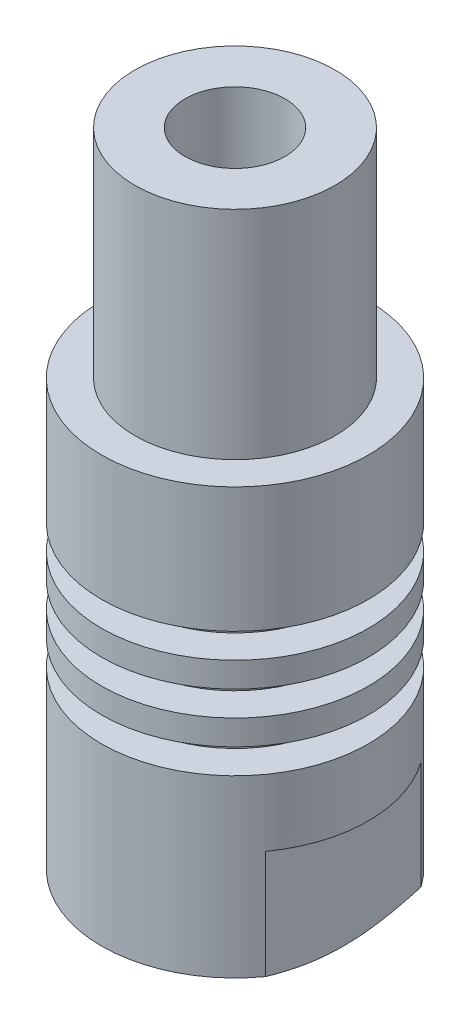
ISO-10303-21;
HEADER;
FILE_DESCRIPTION(('STEP AP214'),'2;1');
FILE_NAME('part.step','',(''),(''),'','','');
FILE_SCHEMA(('AUTOMOTIVE_DESIGN { 1 0 10303 214 1 1 1 1 }'));
ENDSEC;
DATA;
#1=APPLICATION_CONTEXT('core data for automotive mechanical design processes');
#2=APPLICATION_PROTOCOL_DEFINITION('international standard','automotive_design',2000,#1);
#3=PRODUCT_CONTEXT('',#1,'mechanical');
#4=PRODUCT('Part','Part','',(#3));
#5=PRODUCT_RELATED_PRODUCT_CATEGORY('part','',(#4));
#6=PRODUCT_DEFINITION_FORMATION('','',#4);
#7=PRODUCT_DEFINITION_CONTEXT('part definition',#1,'design');
#8=PRODUCT_DEFINITION('design','',#6,#7);
#9=PRODUCT_DEFINITION_SHAPE('','',#8);
#10=(LENGTH_UNIT() NAMED_UNIT(*) SI_UNIT(.MILLI.,.METRE.));
#11=(NAMED_UNIT(*) PLANE_ANGLE_UNIT() SI_UNIT($,.RADIAN.));
#12=(NAMED_UNIT(*) SI_UNIT($,.STERADIAN.) SOLID_ANGLE_UNIT());
#13=UNCERTAINTY_MEASURE_WITH_UNIT(LENGTH_MEASURE(1.E-05),#10,'distance_accuracy_value','');
#14=(GEOMETRIC_REPRESENTATION_CONTEXT(3) GLOBAL_UNCERTAINTY_ASSIGNED_CONTEXT((#13)) GLOBAL_UNIT_ASSIGNED_CONTEXT((#10,
#11,#12)) REPRESENTATION_CONTEXT('',''));
#15=CARTESIAN_POINT('',(0.,0.,0.));
#16=DIRECTION('',(0.,0.,1.));
#17=DIRECTION('',(1.,0.,0.));
#18=AXIS2_PLACEMENT_3D('',#15,#16,#17);
#19=CARTESIAN_POINT('',(0.,129.407380346339,0.));
#20=DIRECTION('',(0.,1.,0.));
#21=DIRECTION('',(0.,0.,1.));
#22=AXIS2_PLACEMENT_3D('',#19,#20,#21);
#23=CYLINDRICAL_SURFACE('',#22,7.99999999999999);
#24=CARTESIAN_POINT('',(0.,19.5,0.));
#25=DIRECTION('',(0.,1.,0.));
#26=DIRECTION('',(0.,0.,1.));
#27=AXIS2_PLACEMENT_3D('',#24,#25,#26);
#28=CIRCLE('',#27,8.);
#29=CARTESIAN_POINT('',(0.,19.5,8.));
#30=VERTEX_POINT('',#29);
#31=EDGE_CURVE('E408',#30,#30,#28,.T.);
#32=ORIENTED_EDGE('',*,*,#31,.T.);
#33=EDGE_LOOP('',(#32));
#34=FACE_BOUND('',#33,.T.);
#35=CARTESIAN_POINT('',(0.,27.,0.));
#36=DIRECTION('',(0.,1.,0.));
#37=DIRECTION('',(0.,0.,1.));
#38=AXIS2_PLACEMENT_3D('',#35,#36,#37);
#39=CIRCLE('',#38,7.99999999999999);
#40=CARTESIAN_POINT('',(0.,27.,7.99999999999999));
#41=VERTEX_POINT('',#40);
#42=EDGE_CURVE('E42',#41,#41,#39,.F.);
#43=ORIENTED_EDGE('',*,*,#42,.T.);
#44=EDGE_LOOP('',(#43));
#45=FACE_BOUND('',#44,.T.);
#46=ADVANCED_FACE('F38',(#34,#45),#23,.T.);
#47=CARTESIAN_POINT('',(-7.99999999999998,40.,0.));
#48=DIRECTION('',(0.,1.,0.));
#49=DIRECTION('',(0.,0.,1.));
#50=AXIS2_PLACEMENT_3D('',#47,#48,#49);
#51=PLANE('',#50);
#52=CARTESIAN_POINT('',(0.,40.,0.));
#53=DIRECTION('',(0.,1.,0.));
#54=DIRECTION('',(0.,0.,1.));
#55=AXIS2_PLACEMENT_3D('',#52,#53,#54);
#56=CIRCLE('',#55,3.);
#57=CARTESIAN_POINT('',(0.,40.,3.));
#58=VERTEX_POINT('',#57);
#59=EDGE_CURVE('E98',#58,#58,#56,.T.);
#60=ORIENTED_EDGE('',*,*,#59,.F.);
#61=EDGE_LOOP('',(#60));
#62=FACE_BOUND('',#61,.T.);
#63=CARTESIAN_POINT('',(0.,40.,0.));
#64=DIRECTION('',(0.,1.,0.));
#65=DIRECTION('',(0.,0.,1.));
#66=AXIS2_PLACEMENT_3D('',#63,#64,#65);
#67=CIRCLE('',#66,6.);
#68=CARTESIAN_POINT('',(0.,40.,6.));
#69=VERTEX_POINT('',#68);
#70=EDGE_CURVE('E247',#69,#69,#67,.T.);
#71=ORIENTED_EDGE('',*,*,#70,.T.);
#72=EDGE_LOOP('',(#71));
#73=FACE_BOUND('',#72,.T.);
#74=ADVANCED_FACE('F160',(#62,#73),#51,.T.);
#75=CARTESIAN_POINT('',(0.,1.5,0.));
#76=DIRECTION('',(0.,1.,0.));
#77=DIRECTION('',(0.,0.,1.));
#78=AXIS2_PLACEMENT_3D('',#75,#76,#77);
#79=CONICAL_SURFACE('',#78,7.99999999999999,1.10714871779409);
#80=CARTESIAN_POINT('',(0.,0.,0.));
#81=DIRECTION('',(0.,1.,0.));
#82=DIRECTION('',(0.,0.,1.));
#83=AXIS2_PLACEMENT_3D('',#80,#81,#82);
#84=CIRCLE('',#83,4.99999999999998);
#85=CARTESIAN_POINT('',(0.,0.,4.99999999999998));
#86=VERTEX_POINT('',#85);
#87=EDGE_CURVE('E12',#86,#86,#84,.T.);
#88=ORIENTED_EDGE('',*,*,#87,.T.);
#89=EDGE_LOOP('',(#88));
#90=FACE_BOUND('',#89,.T.);
#91=CARTESIAN_POINT('',(0.,1.5,0.));
#92=DIRECTION('',(0.,1.,0.));
#93=DIRECTION('',(0.,0.,1.));
#94=AXIS2_PLACEMENT_3D('',#91,#92,#93);
#95=CIRCLE('',#94,7.99999999999999);
#96=CARTESIAN_POINT('',(6.49999999999997,1.5,-4.66368952654442));
#97=VERTEX_POINT('',#96);
#98=CARTESIAN_POINT('',(-6.49999999999997,1.5,-4.66368952654442));
#99=VERTEX_POINT('',#98);
#100=EDGE_CURVE('E96',#97,#99,#95,.T.);
#101=ORIENTED_EDGE('',*,*,#100,.F.);
#102=CARTESIAN_POINT('',(6.49999999999999,4.63960517836139,-12.7140020611741));
#103=CARTESIAN_POINT('',(6.49999999999999,4.49493273691476,-12.3889791438294));
#104=CARTESIAN_POINT('',(6.49999999999999,4.35117750702607,-12.0635434352985));
#105=CARTESIAN_POINT('',(6.49999999999999,4.06600795170587,-11.4116234990025));
#106=CARTESIAN_POINT('',(6.49999999999999,3.92459377917146,-11.0851392044028));
#107=CARTESIAN_POINT('',(6.49999999999999,3.64433543055072,-10.4302489102803));
#108=CARTESIAN_POINT('',(6.49999999999999,3.50549732908588,-10.1018403056813));
#109=CARTESIAN_POINT('',(6.49999999999999,3.23142571950738,-9.44352872623451));
#110=CARTESIAN_POINT('',(6.49999999999999,3.09619212071106,-9.11362578922608));
#111=CARTESIAN_POINT('',(6.49999999999999,2.83048289305681,-8.45250376338199));
#112=CARTESIAN_POINT('',(6.49999999999999,2.70000014874712,-8.12128754257229));
#113=CARTESIAN_POINT('',(6.49999999999999,2.44483186701764,-7.45659634827721));
#114=CARTESIAN_POINT('',(6.49999999999999,2.32014667007343,-7.12312124344746));
#115=CARTESIAN_POINT('',(6.49999999999999,2.07840099908305,-6.45372644486896));
#116=CARTESIAN_POINT('',(6.49999999999999,1.96133416663675,-6.11780905674865));
#117=CARTESIAN_POINT('',(6.49999999999999,1.73702665581905,-5.44272397498847));
#118=CARTESIAN_POINT('',(6.49999999999999,1.62978438251793,-5.10355681882979));
#119=CARTESIAN_POINT('',(6.49999999999999,1.50145760944831,-4.66929022803816));
#120=CARTESIAN_POINT('',(6.49999999999999,1.47439812441263,-4.57594563698323));
#121=CARTESIAN_POINT('',(6.49999999999999,1.42132141191772,-4.38896083134469));
#122=CARTESIAN_POINT('',(6.49999999999999,1.39530416853117,-4.29532062130229));
#123=CARTESIAN_POINT('',(6.49999999999999,1.31884649816979,-4.01363447591895));
#124=CARTESIAN_POINT('',(6.49999999999999,1.27009239909997,-3.82513345071698));
#125=CARTESIAN_POINT('',(6.49999999999999,1.13144347216063,-3.25712110004858));
#126=CARTESIAN_POINT('',(6.49999999999999,1.04932049996449,-2.87562365996438));
#127=CARTESIAN_POINT('',(6.49999999999999,0.946261094020701,-2.29977813127616));
#128=CARTESIAN_POINT('',(6.49999999999999,0.915259699355964,-2.10720712065049));
#129=CARTESIAN_POINT('',(6.49999999999999,0.860714592579146,-1.7210183720728));
#130=CARTESIAN_POINT('',(6.49999999999999,0.837170046736164,-1.52740075360301));
#131=CARTESIAN_POINT('',(6.49999999999999,0.798232474629815,-1.13985753736791));
#132=CARTESIAN_POINT('',(6.49999999999999,0.78281812154265,-0.945934097286736));
#133=CARTESIAN_POINT('',(6.49999999999999,0.760510527948946,-0.557594838663115));
#134=CARTESIAN_POINT('',(6.49999999999999,0.753617189046767,-0.363179025832271));
#135=CARTESIAN_POINT('',(6.49999999999999,0.748572275423311,0.0257307608028582));
#136=CARTESIAN_POINT('',(6.49999999999999,0.750419038007415,0.220224712703199));
#137=CARTESIAN_POINT('',(6.49999999999999,0.76278940638265,0.608953775199544));
#138=CARTESIAN_POINT('',(6.49999999999999,0.773314033718197,0.803188852624818));
#139=CARTESIAN_POINT('',(6.49999999999999,0.806501889662758,1.24090602694894));
#140=CARTESIAN_POINT('',(6.49999999999999,0.831590920516132,1.48420561931385));
#141=CARTESIAN_POINT('',(6.49999999999999,0.893852125406738,1.96924724220696));
#142=CARTESIAN_POINT('',(6.49999999999999,0.931025317420885,2.21098913976373));
#143=CARTESIAN_POINT('',(6.49999999999999,1.01604103903786,2.69277716302994));
#144=CARTESIAN_POINT('',(6.49999999999999,1.06389244038228,2.93282170644527));
#145=CARTESIAN_POINT('',(6.49999999999999,1.16871694054054,3.41088019593747));
#146=CARTESIAN_POINT('',(6.49999999999999,1.22568964445531,3.64889422945387));
#147=CARTESIAN_POINT('',(6.49999999999999,1.34820588611418,4.1264246278799));
#148=CARTESIAN_POINT('',(6.49999999999999,1.41386316573231,4.36591159529887));
#149=CARTESIAN_POINT('',(6.49999999999999,1.55170831935892,4.84285142414976));
#150=CARTESIAN_POINT('',(6.49999999999999,1.62389277522808,5.08030527977033));
#151=CARTESIAN_POINT('',(6.49999999999999,1.77367698683179,5.55344813381403));
#152=CARTESIAN_POINT('',(6.49999999999999,1.85127585874315,5.78913741335531));
#153=CARTESIAN_POINT('',(6.49999999999999,2.01097599435672,6.2590172847031));
#154=CARTESIAN_POINT('',(6.49999999999999,2.09307790629008,6.49320765528824));
#155=CARTESIAN_POINT('',(6.49999999999999,2.28703034641471,7.03262988490792));
#156=CARTESIAN_POINT('',(6.49999999999999,2.40021373679549,7.33738166221177));
#157=CARTESIAN_POINT('',(6.49999999999999,2.63161506867892,7.94497276131788));
#158=CARTESIAN_POINT('',(6.49999999999999,2.74983321640616,8.24781200419785));
#159=CARTESIAN_POINT('',(6.49999999999999,2.99028703034095,8.8519169939098));
#160=CARTESIAN_POINT('',(6.49999999999999,3.11252303289466,9.15318260654962));
#161=CARTESIAN_POINT('',(6.49999999999999,3.36022795848007,9.75438363657073));
#162=CARTESIAN_POINT('',(6.49999999999999,3.4856969285348,10.0543190345298));
#163=CARTESIAN_POINT('',(6.49999999999999,3.8662108131295,10.9529295272112));
#164=CARTESIAN_POINT('',(6.49999999999999,4.12517530296346,11.5499439611486));
#165=CARTESIAN_POINT('',(6.49999999999999,4.65016432189855,12.7407935160942));
#166=CARTESIAN_POINT('',(6.49999999999999,4.91618837224115,13.334628849434));
#167=CARTESIAN_POINT('',(6.49999999999999,5.43683739745572,14.4837436524848));
#168=CARTESIAN_POINT('',(6.49999999999999,5.69116368566189,15.0391586745477));
#169=CARTESIAN_POINT('',(6.49999999999999,6.20312748367828,16.148471829484));
#170=CARTESIAN_POINT('',(6.49999999999999,6.46076506083453,16.7023699312269));
#171=CARTESIAN_POINT('',(6.49999999999999,6.97809934492668,17.8080180985776));
#172=CARTESIAN_POINT('',(6.49999999999999,7.23779164660991,18.3597702278274));
#173=CARTESIAN_POINT('',(6.49999999999999,7.75914833515714,19.4623190137403));
#174=CARTESIAN_POINT('',(6.49999999999999,8.02081265352454,20.0131157027799));
#175=CARTESIAN_POINT('',(6.49999999999999,8.28320577924075,20.5635626171586));
#176=B_SPLINE_CURVE_WITH_KNOTS('',3,(#102,#103,#104,#105,#106,#107,#108,#109,#110,#111,#112,
#113,#114,#115,#116,#117,#118,#119,#120,#121,#122,#123,#124,#125,#126,#127,#128,#129,#130,#131,
#132,#133,#134,#135,#136,#137,#138,#139,#140,#141,#142,#143,#144,#145,#146,#147,#148,#149,#150,
#151,#152,#153,#154,#155,#156,#157,#158,#159,#160,#161,#162,#163,#164,#165,#166,#167,#168,#169,
#170,#171,#172,#173,#174,#175),.UNSPECIFIED.,.F.,.F.,(4,2,2,2,2,2,2,2,2,2,2,2,2,2,2,2,2,2,2,2,2,
2,2,2,2,2,2,2,2,2,2,2,2,2,2,2,4),(0.,1.06730515758636,2.13467974924004,3.20431402837474,
4.27392137202762,5.34185467005331,6.40985060614333,7.47694343200912,8.54386271672926,
8.83542135077924,9.12697552758702,9.71105511301348,10.8808525348457,11.4658873460732,
12.0508567229673,12.6342839007031,13.2177043413035,13.8010137979488,14.3843919306593,
15.1178129637762,15.8512957967343,16.5853903108169,17.31945305149,18.0643130987016,
18.8087853133975,19.5531362870632,20.2975946957999,21.2728075860352,22.2480604596634,
23.2233951834841,24.1987441014193,26.1509456097113,28.1030150621006,29.9356240477088,
31.7682703646555,33.5977016553135,35.4270696921721),.UNSPECIFIED.);
#177=CARTESIAN_POINT('',(6.49999999999997,1.5,4.66368952654442));
#178=VERTEX_POINT('',#177);
#179=EDGE_CURVE('E81',#178,#97,#176,.F.);
#180=ORIENTED_EDGE('',*,*,#179,.F.);
#181=CARTESIAN_POINT('',(-6.49999999999997,1.5,4.66368952654442));
#182=VERTEX_POINT('',#181);
#183=EDGE_CURVE('E47',#182,#178,#95,.T.);
#184=ORIENTED_EDGE('',*,*,#183,.F.);
#185=CARTESIAN_POINT('',(-6.49999999999999,4.63960517836139,-12.7140020611741));
#186=CARTESIAN_POINT('',(-6.49999999999999,4.49493273691476,-12.3889791438294));
#187=CARTESIAN_POINT('',(-6.49999999999999,4.35117750702607,-12.0635434352985));
#188=CARTESIAN_POINT('',(-6.49999999999999,4.06600795170587,-11.4116234990025));
#189=CARTESIAN_POINT('',(-6.49999999999999,3.92459377917146,-11.0851392044028));
#190=CARTESIAN_POINT('',(-6.49999999999999,3.64433543055072,-10.4302489102803));
#191=CARTESIAN_POINT('',(-6.49999999999999,3.50549732908588,-10.1018403056813));
#192=CARTESIAN_POINT('',(-6.49999999999999,3.23142571950738,-9.44352872623451));
#193=CARTESIAN_POINT('',(-6.49999999999999,3.09619212071106,-9.11362578922608));
#194=CARTESIAN_POINT('',(-6.49999999999999,2.83048289305681,-8.45250376338199));
#195=CARTESIAN_POINT('',(-6.49999999999999,2.70000014874712,-8.12128754257229));
#196=CARTESIAN_POINT('',(-6.49999999999999,2.44483186701764,-7.45659634827721));
#197=CARTESIAN_POINT('',(-6.49999999999999,2.32014667007343,-7.12312124344746));
#198=CARTESIAN_POINT('',(-6.49999999999999,2.07840099908305,-6.45372644486896));
#199=CARTESIAN_POINT('',(-6.49999999999999,1.96133416663675,-6.11780905674865));
#200=CARTESIAN_POINT('',(-6.49999999999999,1.73702665581905,-5.44272397498847));
#201=CARTESIAN_POINT('',(-6.49999999999999,1.62978438251793,-5.10355681882979));
#202=CARTESIAN_POINT('',(-6.49999999999999,1.50145760944831,-4.66929022803816));
#203=CARTESIAN_POINT('',(-6.49999999999999,1.47439812441263,-4.57594563698323));
#204=CARTESIAN_POINT('',(-6.49999999999999,1.42132141191772,-4.38896083134469));
#205=CARTESIAN_POINT('',(-6.49999999999999,1.39530416853117,-4.29532062130229));
#206=CARTESIAN_POINT('',(-6.49999999999999,1.31884649816979,-4.01363447591895));
#207=CARTESIAN_POINT('',(-6.49999999999999,1.27009239909997,-3.82513345071698));
#208=CARTESIAN_POINT('',(-6.49999999999999,1.13144347216063,-3.25712110004858));
#209=CARTESIAN_POINT('',(-6.49999999999999,1.04932049996449,-2.87562365996438));
#210=CARTESIAN_POINT('',(-6.49999999999999,0.946261094020701,-2.29977813127616));
#211=CARTESIAN_POINT('',(-6.49999999999999,0.915259699355964,-2.10720712065049));
#212=CARTESIAN_POINT('',(-6.49999999999999,0.860714592579146,-1.7210183720728));
#213=CARTESIAN_POINT('',(-6.49999999999999,0.837170046736164,-1.52740075360301));
#214=CARTESIAN_POINT('',(-6.49999999999999,0.798232474629815,-1.13985753736791));
#215=CARTESIAN_POINT('',(-6.49999999999999,0.78281812154265,-0.945934097286736));
#216=CARTESIAN_POINT('',(-6.49999999999999,0.760510527948946,-0.557594838663115));
#217=CARTESIAN_POINT('',(-6.49999999999999,0.753617189046767,-0.363179025832271));
#218=CARTESIAN_POINT('',(-6.49999999999999,0.748572275423311,0.0257307608028582));
#219=CARTESIAN_POINT('',(-6.49999999999999,0.750419038007415,0.220224712703199));
#220=CARTESIAN_POINT('',(-6.49999999999999,0.76278940638265,0.608953775199544));
#221=CARTESIAN_POINT('',(-6.49999999999999,0.773314033718197,0.803188852624818));
#222=CARTESIAN_POINT('',(-6.49999999999999,0.806501889662758,1.24090602694894));
#223=CARTESIAN_POINT('',(-6.49999999999999,0.831590920516132,1.48420561931385));
#224=CARTESIAN_POINT('',(-6.49999999999999,0.893852125406738,1.96924724220696));
#225=CARTESIAN_POINT('',(-6.49999999999999,0.931025317420885,2.21098913976373));
#226=CARTESIAN_POINT('',(-6.49999999999999,1.01604103903786,2.69277716302994));
#227=CARTESIAN_POINT('',(-6.49999999999999,1.06389244038228,2.93282170644527));
#228=CARTESIAN_POINT('',(-6.49999999999999,1.16871694054054,3.41088019593747));
#229=CARTESIAN_POINT('',(-6.49999999999999,1.22568964445531,3.64889422945387));
#230=CARTESIAN_POINT('',(-6.49999999999999,1.34820588611418,4.1264246278799));
#231=CARTESIAN_POINT('',(-6.49999999999999,1.41386316573231,4.36591159529887));
#232=CARTESIAN_POINT('',(-6.49999999999999,1.55170831935892,4.84285142414976));
#233=CARTESIAN_POINT('',(-6.49999999999999,1.62389277522808,5.08030527977033));
#234=CARTESIAN_POINT('',(-6.49999999999999,1.77367698683179,5.55344813381403));
#235=CARTESIAN_POINT('',(-6.49999999999999,1.85127585874315,5.78913741335531));
#236=CARTESIAN_POINT('',(-6.49999999999999,2.01097599435672,6.2590172847031));
#237=CARTESIAN_POINT('',(-6.49999999999999,2.09307790629008,6.49320765528824));
#238=CARTESIAN_POINT('',(-6.49999999999999,2.28703034641471,7.03262988490792));
#239=CARTESIAN_POINT('',(-6.49999999999999,2.40021373679549,7.33738166221177));
#240=CARTESIAN_POINT('',(-6.49999999999999,2.63161506867892,7.94497276131788));
#241=CARTESIAN_POINT('',(-6.49999999999999,2.74983321640616,8.24781200419785));
#242=CARTESIAN_POINT('',(-6.49999999999999,2.99028703034095,8.8519169939098));
#243=CARTESIAN_POINT('',(-6.49999999999999,3.11252303289466,9.15318260654962));
#244=CARTESIAN_POINT('',(-6.49999999999999,3.36022795848007,9.75438363657073));
#245=CARTESIAN_POINT('',(-6.49999999999999,3.4856969285348,10.0543190345298));
#246=CARTESIAN_POINT('',(-6.49999999999999,3.8662108131295,10.9529295272112));
#247=CARTESIAN_POINT('',(-6.49999999999999,4.12517530296346,11.5499439611486));
#248=CARTESIAN_POINT('',(-6.49999999999999,4.65016432189855,12.7407935160942));
#249=CARTESIAN_POINT('',(-6.49999999999999,4.91618837224115,13.334628849434));
#250=CARTESIAN_POINT('',(-6.49999999999999,5.43683739745572,14.4837436524848));
#251=CARTESIAN_POINT('',(-6.49999999999999,5.69116368566189,15.0391586745477));
#252=CARTESIAN_POINT('',(-6.49999999999999,6.20312748367828,16.148471829484));
#253=CARTESIAN_POINT('',(-6.49999999999999,6.46076506083453,16.7023699312269));
#254=CARTESIAN_POINT('',(-6.49999999999999,6.97809934492668,17.8080180985776));
#255=CARTESIAN_POINT('',(-6.49999999999999,7.23779164660991,18.3597702278274));
#256=CARTESIAN_POINT('',(-6.49999999999999,7.75914833515714,19.4623190137403));
#257=CARTESIAN_POINT('',(-6.49999999999999,8.02081265352454,20.0131157027799));
#258=CARTESIAN_POINT('',(-6.49999999999999,8.28320577924075,20.5635626171586));
#259=B_SPLINE_CURVE_WITH_KNOTS('',3,(#185,#186,#187,#188,#189,#190,#191,#192,#193,#194,#195,
#196,#197,#198,#199,#200,#201,#202,#203,#204,#205,#206,#207,#208,#209,#210,#211,#212,#213,#214,
#215,#216,#217,#218,#219,#220,#221,#222,#223,#224,#225,#226,#227,#228,#229,#230,#231,#232,#233,
#234,#235,#236,#237,#238,#239,#240,#241,#242,#243,#244,#245,#246,#247,#248,#249,#250,#251,#252,
#253,#254,#255,#256,#257,#258),.UNSPECIFIED.,.F.,.F.,(4,2,2,2,2,2,2,2,2,2,2,2,2,2,2,2,2,2,2,2,2,
2,2,2,2,2,2,2,2,2,2,2,2,2,2,2,4),(0.,1.06730515758636,2.13467974924004,3.20431402837474,
4.27392137202762,5.34185467005331,6.40985060614333,7.47694343200912,8.54386271672926,
8.83542135077924,9.12697552758702,9.71105511301348,10.8808525348457,11.4658873460732,
12.0508567229673,12.6342839007031,13.2177043413035,13.8010137979488,14.3843919306593,
15.1178129637762,15.8512957967343,16.5853903108169,17.31945305149,18.0643130987016,
18.8087853133975,19.5531362870632,20.2975946957999,21.2728075860352,22.2480604596634,
23.2233951834841,24.1987441014193,26.1509456097113,28.1030150621006,29.9356240477088,
31.7682703646555,33.5977016553135,35.4270696921721),.UNSPECIFIED.);
#260=EDGE_CURVE('E102',#99,#182,#259,.T.);
#261=ORIENTED_EDGE('',*,*,#260,.F.);
#262=EDGE_LOOP('',(#101,#180,#184,#261));
#263=FACE_BOUND('',#262,.T.);
#264=ADVANCED_FACE('F101',(#90,#263),#79,.T.);
#265=CARTESIAN_POINT('',(0.,129.407380346339,0.));
#266=DIRECTION('',(0.,1.,0.));
#267=DIRECTION('',(0.,0.,1.));
#268=AXIS2_PLACEMENT_3D('',#265,#266,#267);
#269=CYLINDRICAL_SURFACE('',#268,7.99999999999999);
#270=CARTESIAN_POINT('',(0.,12.,0.));
#271=DIRECTION('',(0.,1.,0.));
#272=DIRECTION('',(0.,0.,1.));
#273=AXIS2_PLACEMENT_3D('',#270,#271,#272);
#274=CIRCLE('',#273,7.99999999999998);
#275=CARTESIAN_POINT('',(0.,12.,7.99999999999998));
#276=VERTEX_POINT('',#275);
#277=EDGE_CURVE('E103',#276,#276,#274,.T.);
#278=ORIENTED_EDGE('',*,*,#277,.F.);
#279=EDGE_LOOP('',(#278));
#280=FACE_BOUND('',#279,.T.);
#281=CARTESIAN_POINT('',(0.,7.99999999999999,0.));
#282=DIRECTION('',(0.,-1.,0.));
#283=DIRECTION('',(0.,0.,-1.));
#284=AXIS2_PLACEMENT_3D('',#281,#282,#283);
#285=CIRCLE('',#284,7.99999999999999);
#286=CARTESIAN_POINT('',(6.49999999999999,7.99999999999999,-4.6636895265444));
#287=VERTEX_POINT('',#286);
#288=CARTESIAN_POINT('',(6.49999999999997,7.99999999999999,4.66368952654442));
#289=VERTEX_POINT('',#288);
#290=EDGE_CURVE('E54',#287,#289,#285,.T.);
#291=ORIENTED_EDGE('',*,*,#290,.F.);
#292=DIRECTION('',(0.,1.,0.));
#293=VECTOR('',#292,1.);
#294=CARTESIAN_POINT('',(6.49999999999997,129.407380346339,-4.66368952654442));
#295=LINE('',#294,#293);
#296=EDGE_CURVE('E84',#287,#97,#295,.F.);
#297=ORIENTED_EDGE('',*,*,#296,.T.);
#298=ORIENTED_EDGE('',*,*,#100,.T.);
#299=DIRECTION('',(0.,1.,0.));
#300=VECTOR('',#299,1.);
#301=CARTESIAN_POINT('',(-6.49999999999997,129.407380346339,-4.66368952654442));
#302=LINE('',#301,#300);
#303=CARTESIAN_POINT('',(-6.49999999999999,7.99999999999999,-4.6636895265444));
#304=VERTEX_POINT('',#303);
#305=EDGE_CURVE('E407',#99,#304,#302,.T.);
#306=ORIENTED_EDGE('',*,*,#305,.T.);
#307=CARTESIAN_POINT('',(0.,7.99999999999998,0.));
#308=DIRECTION('',(0.,-1.,0.));
#309=DIRECTION('',(1.,0.,0.));
#310=AXIS2_PLACEMENT_3D('',#307,#308,#309);
#311=CIRCLE('',#310,7.99999999999999);
#312=CARTESIAN_POINT('',(-6.49999999999999,7.99999999999999,4.6636895265444));
#313=VERTEX_POINT('',#312);
#314=EDGE_CURVE('E406',#313,#304,#311,.T.);
#315=ORIENTED_EDGE('',*,*,#314,.F.);
#316=DIRECTION('',(0.,1.,0.));
#317=VECTOR('',#316,1.);
#318=CARTESIAN_POINT('',(-6.49999999999997,129.407380346339,4.66368952654442));
#319=LINE('',#318,#317);
#320=EDGE_CURVE('E62',#182,#313,#319,.T.);
#321=ORIENTED_EDGE('',*,*,#320,.F.);
#322=ORIENTED_EDGE('',*,*,#183,.T.);
#323=DIRECTION('',(0.,1.,0.));
#324=VECTOR('',#323,1.);
#325=CARTESIAN_POINT('',(6.49999999999997,129.407380346339,4.66368952654442));
#326=LINE('',#325,#324);
#327=EDGE_CURVE('E86',#289,#178,#326,.F.);
#328=ORIENTED_EDGE('',*,*,#327,.F.);
#329=EDGE_LOOP('',(#291,#297,#298,#306,#315,#321,#322,#328));
#330=FACE_BOUND('',#329,.T.);
#331=ADVANCED_FACE('F94',(#280,#330),#269,.T.);
#332=CARTESIAN_POINT('',(0.,0.,0.));
#333=DIRECTION('',(0.,-1.,0.));
#334=DIRECTION('',(0.,0.,-1.));
#335=AXIS2_PLACEMENT_3D('',#332,#333,#334);
#336=PLANE('',#335);
#337=CARTESIAN_POINT('',(0.,0.,0.));
#338=DIRECTION('',(0.,-1.,0.));
#339=DIRECTION('',(0.,0.,-1.));
#340=AXIS2_PLACEMENT_3D('',#337,#338,#339);
#341=CIRCLE('',#340,3.39999999999999);
#342=CARTESIAN_POINT('',(0.,0.,-3.39999999999999));
#343=VERTEX_POINT('',#342);
#344=EDGE_CURVE('E117',#343,#343,#341,.T.);
#345=ORIENTED_EDGE('',*,*,#344,.F.);
#346=EDGE_LOOP('',(#345));
#347=FACE_BOUND('',#346,.T.);
#348=ORIENTED_EDGE('',*,*,#87,.F.);
#349=EDGE_LOOP('',(#348));
#350=FACE_BOUND('',#349,.T.);
#351=ADVANCED_FACE('F40',(#347,#350),#336,.T.);
#352=CARTESIAN_POINT('',(-7.99999999999998,12.,0.));
#353=DIRECTION('',(0.,1.,0.));
#354=DIRECTION('',(0.,0.,1.));
#355=AXIS2_PLACEMENT_3D('',#352,#353,#354);
#356=PLANE('',#355);
#357=ORIENTED_EDGE('',*,*,#277,.T.);
#358=EDGE_LOOP('',(#357));
#359=FACE_BOUND('',#358,.T.);
#360=CARTESIAN_POINT('',(0.,12.,0.));
#361=DIRECTION('',(0.,1.,0.));
#362=DIRECTION('',(0.,0.,1.));
#363=AXIS2_PLACEMENT_3D('',#360,#361,#362);
#364=CIRCLE('',#363,5.99999999999999);
#365=CARTESIAN_POINT('',(0.,12.,5.99999999999999));
#366=VERTEX_POINT('',#365);
#367=EDGE_CURVE('E106',#366,#366,#364,.T.);
#368=ORIENTED_EDGE('',*,*,#367,.F.);
#369=EDGE_LOOP('',(#368));
#370=FACE_BOUND('',#369,.T.);
#371=ADVANCED_FACE('F205',(#359,#370),#356,.T.);
#372=CARTESIAN_POINT('',(0.,129.407380346339,0.));
#373=DIRECTION('',(0.,1.,0.));
#374=DIRECTION('',(0.,0.,1.));
#375=AXIS2_PLACEMENT_3D('',#372,#373,#374);
#376=CYLINDRICAL_SURFACE('',#375,5.99999999999999);
#377=ORIENTED_EDGE('',*,*,#367,.T.);
#378=EDGE_LOOP('',(#377));
#379=FACE_BOUND('',#378,.T.);
#380=CARTESIAN_POINT('',(0.,13.5,0.));
#381=DIRECTION('',(0.,1.,0.));
#382=DIRECTION('',(0.,0.,1.));
#383=AXIS2_PLACEMENT_3D('',#380,#381,#382);
#384=CIRCLE('',#383,5.99999999999999);
#385=CARTESIAN_POINT('',(0.,13.5,5.99999999999999));
#386=VERTEX_POINT('',#385);
#387=EDGE_CURVE('E436',#386,#386,#384,.T.);
#388=ORIENTED_EDGE('',*,*,#387,.F.);
#389=EDGE_LOOP('',(#388));
#390=FACE_BOUND('',#389,.T.);
#391=ADVANCED_FACE('F201',(#379,#390),#376,.T.);
#392=CARTESIAN_POINT('',(-5.99999999999999,13.5,0.));
#393=DIRECTION('',(0.,-1.,0.));
#394=DIRECTION('',(0.,0.,-1.));
#395=AXIS2_PLACEMENT_3D('',#392,#393,#394);
#396=PLANE('',#395);
#397=ORIENTED_EDGE('',*,*,#387,.T.);
#398=EDGE_LOOP('',(#397));
#399=FACE_BOUND('',#398,.T.);
#400=CARTESIAN_POINT('',(0.,13.5,0.));
#401=DIRECTION('',(0.,1.,0.));
#402=DIRECTION('',(0.,0.,1.));
#403=AXIS2_PLACEMENT_3D('',#400,#401,#402);
#404=CIRCLE('',#403,8.);
#405=CARTESIAN_POINT('',(0.,13.5,8.));
#406=VERTEX_POINT('',#405);
#407=EDGE_CURVE('E433',#406,#406,#404,.T.);
#408=ORIENTED_EDGE('',*,*,#407,.F.);
#409=EDGE_LOOP('',(#408));
#410=FACE_BOUND('',#409,.T.);
#411=ADVANCED_FACE('F197',(#399,#410),#396,.T.);
#412=CARTESIAN_POINT('',(0.,129.407380346339,0.));
#413=DIRECTION('',(0.,1.,0.));
#414=DIRECTION('',(0.,0.,1.));
#415=AXIS2_PLACEMENT_3D('',#412,#413,#414);
#416=CYLINDRICAL_SURFACE('',#415,8.);
#417=ORIENTED_EDGE('',*,*,#407,.T.);
#418=EDGE_LOOP('',(#417));
#419=FACE_BOUND('',#418,.T.);
#420=CARTESIAN_POINT('',(0.,15.,0.));
#421=DIRECTION('',(0.,1.,0.));
#422=DIRECTION('',(0.,0.,1.));
#423=AXIS2_PLACEMENT_3D('',#420,#421,#422);
#424=CIRCLE('',#423,8.);
#425=CARTESIAN_POINT('',(0.,15.,8.));
#426=VERTEX_POINT('',#425);
#427=EDGE_CURVE('E430',#426,#426,#424,.T.);
#428=ORIENTED_EDGE('',*,*,#427,.F.);
#429=EDGE_LOOP('',(#428));
#430=FACE_BOUND('',#429,.T.);
#431=ADVANCED_FACE('F193',(#419,#430),#416,.T.);
#432=CARTESIAN_POINT('',(-8.,15.,0.));
#433=DIRECTION('',(0.,1.,0.));
#434=DIRECTION('',(0.,0.,1.));
#435=AXIS2_PLACEMENT_3D('',#432,#433,#434);
#436=PLANE('',#435);
#437=ORIENTED_EDGE('',*,*,#427,.T.);
#438=EDGE_LOOP('',(#437));
#439=FACE_BOUND('',#438,.T.);
#440=CARTESIAN_POINT('',(0.,15.,0.));
#441=DIRECTION('',(0.,1.,0.));
#442=DIRECTION('',(0.,0.,1.));
#443=AXIS2_PLACEMENT_3D('',#440,#441,#442);
#444=CIRCLE('',#443,6.);
#445=CARTESIAN_POINT('',(0.,15.,6.));
#446=VERTEX_POINT('',#445);
#447=EDGE_CURVE('E427',#446,#446,#444,.T.);
#448=ORIENTED_EDGE('',*,*,#447,.F.);
#449=EDGE_LOOP('',(#448));
#450=FACE_BOUND('',#449,.T.);
#451=ADVANCED_FACE('F189',(#439,#450),#436,.T.);
#452=CARTESIAN_POINT('',(0.,129.407380346339,0.));
#453=DIRECTION('',(0.,1.,0.));
#454=DIRECTION('',(0.,0.,1.));
#455=AXIS2_PLACEMENT_3D('',#452,#453,#454);
#456=CYLINDRICAL_SURFACE('',#455,6.);
#457=ORIENTED_EDGE('',*,*,#447,.T.);
#458=EDGE_LOOP('',(#457));
#459=FACE_BOUND('',#458,.T.);
#460=CARTESIAN_POINT('',(0.,16.5,0.));
#461=DIRECTION('',(0.,1.,0.));
#462=DIRECTION('',(0.,0.,1.));
#463=AXIS2_PLACEMENT_3D('',#460,#461,#462);
#464=CIRCLE('',#463,6.);
#465=CARTESIAN_POINT('',(0.,16.5,6.));
#466=VERTEX_POINT('',#465);
#467=EDGE_CURVE('E424',#466,#466,#464,.T.);
#468=ORIENTED_EDGE('',*,*,#467,.F.);
#469=EDGE_LOOP('',(#468));
#470=FACE_BOUND('',#469,.T.);
#471=ADVANCED_FACE('F185',(#459,#470),#456,.T.);
#472=CARTESIAN_POINT('',(-6.,16.5,0.));
#473=DIRECTION('',(0.,-1.,0.));
#474=DIRECTION('',(0.,0.,-1.));
#475=AXIS2_PLACEMENT_3D('',#472,#473,#474);
#476=PLANE('',#475);
#477=ORIENTED_EDGE('',*,*,#467,.T.);
#478=EDGE_LOOP('',(#477));
#479=FACE_BOUND('',#478,.T.);
#480=CARTESIAN_POINT('',(0.,16.5,0.));
#481=DIRECTION('',(0.,1.,0.));
#482=DIRECTION('',(0.,0.,1.));
#483=AXIS2_PLACEMENT_3D('',#480,#481,#482);
#484=CIRCLE('',#483,8.);
#485=CARTESIAN_POINT('',(0.,16.5,8.));
#486=VERTEX_POINT('',#485);
#487=EDGE_CURVE('E421',#486,#486,#484,.T.);
#488=ORIENTED_EDGE('',*,*,#487,.F.);
#489=EDGE_LOOP('',(#488));
#490=FACE_BOUND('',#489,.T.);
#491=ADVANCED_FACE('F181',(#479,#490),#476,.T.);
#492=CARTESIAN_POINT('',(0.,129.407380346339,0.));
#493=DIRECTION('',(0.,1.,0.));
#494=DIRECTION('',(0.,0.,1.));
#495=AXIS2_PLACEMENT_3D('',#492,#493,#494);
#496=CYLINDRICAL_SURFACE('',#495,8.);
#497=ORIENTED_EDGE('',*,*,#487,.T.);
#498=EDGE_LOOP('',(#497));
#499=FACE_BOUND('',#498,.T.);
#500=CARTESIAN_POINT('',(0.,18.,0.));
#501=DIRECTION('',(0.,1.,0.));
#502=DIRECTION('',(0.,0.,1.));
#503=AXIS2_PLACEMENT_3D('',#500,#501,#502);
#504=CIRCLE('',#503,8.);
#505=CARTESIAN_POINT('',(0.,18.,8.));
#506=VERTEX_POINT('',#505);
#507=EDGE_CURVE('E418',#506,#506,#504,.T.);
#508=ORIENTED_EDGE('',*,*,#507,.F.);
#509=EDGE_LOOP('',(#508));
#510=FACE_BOUND('',#509,.T.);
#511=ADVANCED_FACE('F177',(#499,#510),#496,.T.);
#512=CARTESIAN_POINT('',(-8.,18.,0.));
#513=DIRECTION('',(0.,1.,0.));
#514=DIRECTION('',(0.,0.,1.));
#515=AXIS2_PLACEMENT_3D('',#512,#513,#514);
#516=PLANE('',#515);
#517=ORIENTED_EDGE('',*,*,#507,.T.);
#518=EDGE_LOOP('',(#517));
#519=FACE_BOUND('',#518,.T.);
#520=CARTESIAN_POINT('',(0.,18.,0.));
#521=DIRECTION('',(0.,1.,0.));
#522=DIRECTION('',(0.,0.,1.));
#523=AXIS2_PLACEMENT_3D('',#520,#521,#522);
#524=CIRCLE('',#523,6.);
#525=CARTESIAN_POINT('',(0.,18.,6.));
#526=VERTEX_POINT('',#525);
#527=EDGE_CURVE('E413',#526,#526,#524,.T.);
#528=ORIENTED_EDGE('',*,*,#527,.F.);
#529=EDGE_LOOP('',(#528));
#530=FACE_BOUND('',#529,.T.);
#531=ADVANCED_FACE('F173',(#519,#530),#516,.T.);
#532=CARTESIAN_POINT('',(0.,129.407380346339,0.));
#533=DIRECTION('',(0.,1.,0.));
#534=DIRECTION('',(0.,0.,1.));
#535=AXIS2_PLACEMENT_3D('',#532,#533,#534);
#536=CYLINDRICAL_SURFACE('',#535,6.);
#537=ORIENTED_EDGE('',*,*,#527,.T.);
#538=EDGE_LOOP('',(#537));
#539=FACE_BOUND('',#538,.T.);
#540=CARTESIAN_POINT('',(0.,19.5,0.));
#541=DIRECTION('',(0.,1.,0.));
#542=DIRECTION('',(0.,0.,1.));
#543=AXIS2_PLACEMENT_3D('',#540,#541,#542);
#544=CIRCLE('',#543,6.);
#545=CARTESIAN_POINT('',(0.,19.5,6.));
#546=VERTEX_POINT('',#545);
#547=EDGE_CURVE('E410',#546,#546,#544,.T.);
#548=ORIENTED_EDGE('',*,*,#547,.F.);
#549=EDGE_LOOP('',(#548));
#550=FACE_BOUND('',#549,.T.);
#551=ADVANCED_FACE('F169',(#539,#550),#536,.T.);
#552=CARTESIAN_POINT('',(-6.,19.5,0.));
#553=DIRECTION('',(0.,-1.,0.));
#554=DIRECTION('',(0.,0.,-1.));
#555=AXIS2_PLACEMENT_3D('',#552,#553,#554);
#556=PLANE('',#555);
#557=ORIENTED_EDGE('',*,*,#547,.T.);
#558=EDGE_LOOP('',(#557));
#559=FACE_BOUND('',#558,.T.);
#560=ORIENTED_EDGE('',*,*,#31,.F.);
#561=EDGE_LOOP('',(#560));
#562=FACE_BOUND('',#561,.T.);
#563=ADVANCED_FACE('F159',(#559,#562),#556,.T.);
#564=CARTESIAN_POINT('',(-6.49999999999999,7.99999999999999,8.001));
#565=DIRECTION('',(-1.,0.,0.));
#566=DIRECTION('',(0.,-1.,0.));
#567=AXIS2_PLACEMENT_3D('',#564,#565,#566);
#568=PLANE('',#567);
#569=ORIENTED_EDGE('',*,*,#260,.T.);
#570=ORIENTED_EDGE('',*,*,#320,.T.);
#571=DIRECTION('',(0.,0.,-1.));
#572=VECTOR('',#571,1.);
#573=CARTESIAN_POINT('',(-6.49999999999999,7.99999999999999,8.001));
#574=LINE('',#573,#572);
#575=EDGE_CURVE('E152',#313,#304,#574,.T.);
#576=ORIENTED_EDGE('',*,*,#575,.T.);
#577=ORIENTED_EDGE('',*,*,#305,.F.);
#578=EDGE_LOOP('',(#569,#570,#576,#577));
#579=FACE_BOUND('',#578,.T.);
#580=ADVANCED_FACE('F155',(#579),#568,.T.);
#581=CARTESIAN_POINT('',(-7.99999999999999,7.99999999999999,8.001));
#582=DIRECTION('',(0.,-1.,0.));
#583=DIRECTION('',(1.,0.,0.));
#584=AXIS2_PLACEMENT_3D('',#581,#582,#583);
#585=PLANE('',#584);
#586=ORIENTED_EDGE('',*,*,#314,.T.);
#587=ORIENTED_EDGE('',*,*,#575,.F.);
#588=EDGE_LOOP('',(#586,#587));
#589=FACE_BOUND('',#588,.T.);
#590=ADVANCED_FACE('F142',(#589),#585,.T.);
#591=CARTESIAN_POINT('',(7.99999999999999,7.99999999999999,8.001));
#592=DIRECTION('',(0.,-1.,0.));
#593=DIRECTION('',(0.,0.,-1.));
#594=AXIS2_PLACEMENT_3D('',#591,#592,#593);
#595=PLANE('',#594);
#596=ORIENTED_EDGE('',*,*,#290,.T.);
#597=DIRECTION('',(0.,0.,-1.));
#598=VECTOR('',#597,1.);
#599=CARTESIAN_POINT('',(6.49999999999999,7.99999999999999,8.001));
#600=LINE('',#599,#598);
#601=EDGE_CURVE('E91',#289,#287,#600,.T.);
#602=ORIENTED_EDGE('',*,*,#601,.T.);
#603=EDGE_LOOP('',(#596,#602));
#604=FACE_BOUND('',#603,.T.);
#605=ADVANCED_FACE('F139',(#604),#595,.T.);
#606=CARTESIAN_POINT('',(6.49999999999999,7.99999999999999,8.001));
#607=DIRECTION('',(1.,0.,0.));
#608=DIRECTION('',(0.,1.,0.));
#609=AXIS2_PLACEMENT_3D('',#606,#607,#608);
#610=PLANE('',#609);
#611=ORIENTED_EDGE('',*,*,#179,.T.);
#612=ORIENTED_EDGE('',*,*,#296,.F.);
#613=ORIENTED_EDGE('',*,*,#601,.F.);
#614=ORIENTED_EDGE('',*,*,#327,.T.);
#615=EDGE_LOOP('',(#611,#612,#613,#614));
#616=FACE_BOUND('',#615,.T.);
#617=ADVANCED_FACE('F83',(#616),#610,.T.);
#618=CARTESIAN_POINT('',(0.,0.,0.));
#619=DIRECTION('',(0.,1.,0.));
#620=DIRECTION('',(0.,0.,1.));
#621=AXIS2_PLACEMENT_3D('',#618,#619,#620);
#622=CYLINDRICAL_SURFACE('',#621,3.);
#623=CARTESIAN_POINT('',(0.,12.240344247611,0.));
#624=DIRECTION('',(0.,-1.,0.));
#625=DIRECTION('',(0.,0.,-1.));
#626=AXIS2_PLACEMENT_3D('',#623,#624,#625);
#627=CIRCLE('',#626,3.);
#628=CARTESIAN_POINT('',(0.,12.240344247611,-3.));
#629=VERTEX_POINT('',#628);
#630=EDGE_CURVE('E109',#629,#629,#627,.T.);
#631=ORIENTED_EDGE('',*,*,#630,.T.);
#632=EDGE_LOOP('',(#631));
#633=FACE_BOUND('',#632,.T.);
#634=ORIENTED_EDGE('',*,*,#59,.T.);
#635=EDGE_LOOP('',(#634));
#636=FACE_BOUND('',#635,.T.);
#637=ADVANCED_FACE('F138',(#633,#636),#622,.F.);
#638=CARTESIAN_POINT('',(0.,12.,0.));
#639=DIRECTION('',(0.,-1.,0.));
#640=DIRECTION('',(0.,0.,-1.));
#641=AXIS2_PLACEMENT_3D('',#638,#639,#640);
#642=CONICAL_SURFACE('',#641,3.4,1.02974425867665);
#643=CARTESIAN_POINT('',(0.,12.,0.));
#644=DIRECTION('',(0.,-1.,0.));
#645=DIRECTION('',(0.,0.,-1.));
#646=AXIS2_PLACEMENT_3D('',#643,#644,#645);
#647=CIRCLE('',#646,3.4);
#648=CARTESIAN_POINT('',(0.,12.,-3.4));
#649=VERTEX_POINT('',#648);
#650=EDGE_CURVE('E111',#649,#649,#647,.T.);
#651=ORIENTED_EDGE('',*,*,#650,.T.);
#652=EDGE_LOOP('',(#651));
#653=FACE_BOUND('',#652,.T.);
#654=ORIENTED_EDGE('',*,*,#630,.F.);
#655=EDGE_LOOP('',(#654));
#656=FACE_BOUND('',#655,.T.);
#657=ADVANCED_FACE('F227',(#653,#656),#642,.F.);
#658=CARTESIAN_POINT('',(0.,0.,0.));
#659=DIRECTION('',(0.,-1.,0.));
#660=DIRECTION('',(0.,0.,-1.));
#661=AXIS2_PLACEMENT_3D('',#658,#659,#660);
#662=CYLINDRICAL_SURFACE('',#661,3.39999999999999);
#663=ORIENTED_EDGE('',*,*,#650,.F.);
#664=EDGE_LOOP('',(#663));
#665=FACE_BOUND('',#664,.T.);
#666=ORIENTED_EDGE('',*,*,#344,.T.);
#667=EDGE_LOOP('',(#666));
#668=FACE_BOUND('',#667,.T.);
#669=ADVANCED_FACE('F224',(#665,#668),#662,.F.);
#670=CARTESIAN_POINT('',(0.,27.,0.));
#671=DIRECTION('',(0.,1.,0.));
#672=DIRECTION('',(0.,0.,1.));
#673=AXIS2_PLACEMENT_3D('',#670,#671,#672);
#674=PLANE('',#673);
#675=ORIENTED_EDGE('',*,*,#42,.F.);
#676=EDGE_LOOP('',(#675));
#677=FACE_BOUND('',#676,.T.);
#678=CARTESIAN_POINT('',(0.,27.,0.));
#679=DIRECTION('',(0.,1.,0.));
#680=DIRECTION('',(0.,0.,1.));
#681=AXIS2_PLACEMENT_3D('',#678,#679,#680);
#682=CIRCLE('',#681,6.);
#683=CARTESIAN_POINT('',(0.,27.,6.));
#684=VERTEX_POINT('',#683);
#685=EDGE_CURVE('E249',#684,#684,#682,.T.);
#686=ORIENTED_EDGE('',*,*,#685,.F.);
#687=EDGE_LOOP('',(#686));
#688=FACE_BOUND('',#687,.T.);
#689=ADVANCED_FACE('F226',(#677,#688),#674,.T.);
#690=CARTESIAN_POINT('',(0.,27.,0.));
#691=DIRECTION('',(0.,1.,0.));
#692=DIRECTION('',(0.,0.,1.));
#693=AXIS2_PLACEMENT_3D('',#690,#691,#692);
#694=CYLINDRICAL_SURFACE('',#693,6.);
#695=ORIENTED_EDGE('',*,*,#685,.T.);
#696=EDGE_LOOP('',(#695));
#697=FACE_BOUND('',#696,.T.);
#698=ORIENTED_EDGE('',*,*,#70,.F.);
#699=EDGE_LOOP('',(#698));
#700=FACE_BOUND('',#699,.T.);
#701=ADVANCED_FACE('F234',(#697,#700),#694,.T.);
#702=CLOSED_SHELL('',(#46,#74,#264,#331,#351,#371,#391,#411,#431,#451,#471,#491,#511,#531,#551,
#563,#580,#590,#605,#617,#637,#657,#669,#689,#701));
#703=MANIFOLD_SOLID_BREP('B2',#702);
#704=ADVANCED_BREP_SHAPE_REPRESENTATION('',(#18,#703),#14);
#705=SHAPE_DEFINITION_REPRESENTATION(#9,#704);
ENDSEC;
END-ISO-10303-21;
